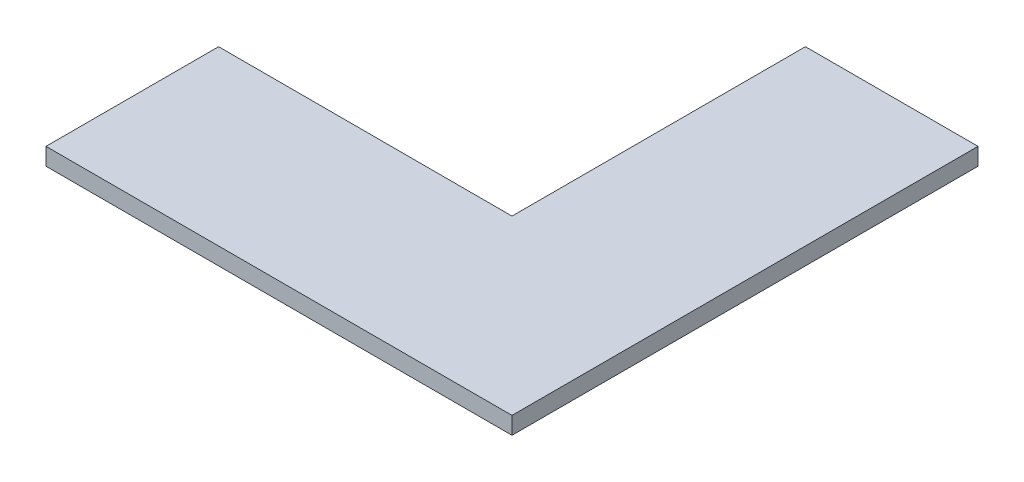
ISO-10303-21;
HEADER;
FILE_DESCRIPTION(('STEP AP214'),'2;1');
FILE_NAME('part.step','',(''),(''),'','','');
FILE_SCHEMA(('AUTOMOTIVE_DESIGN { 1 0 10303 214 1 1 1 1 }'));
ENDSEC;
DATA;
#1=APPLICATION_CONTEXT('core data for automotive mechanical design processes');
#2=APPLICATION_PROTOCOL_DEFINITION('international standard','automotive_design',2000,#1);
#3=PRODUCT_CONTEXT('',#1,'mechanical');
#4=PRODUCT('Part','Part','',(#3));
#5=PRODUCT_RELATED_PRODUCT_CATEGORY('part','',(#4));
#6=PRODUCT_DEFINITION_FORMATION('','',#4);
#7=PRODUCT_DEFINITION_CONTEXT('part definition',#1,'design');
#8=PRODUCT_DEFINITION('design','',#6,#7);
#9=PRODUCT_DEFINITION_SHAPE('','',#8);
#10=(LENGTH_UNIT() NAMED_UNIT(*) SI_UNIT(.MILLI.,.METRE.));
#11=(NAMED_UNIT(*) PLANE_ANGLE_UNIT() SI_UNIT($,.RADIAN.));
#12=(NAMED_UNIT(*) SI_UNIT($,.STERADIAN.) SOLID_ANGLE_UNIT());
#13=UNCERTAINTY_MEASURE_WITH_UNIT(LENGTH_MEASURE(1.E-05),#10,'distance_accuracy_value','');
#14=(GEOMETRIC_REPRESENTATION_CONTEXT(3) GLOBAL_UNCERTAINTY_ASSIGNED_CONTEXT((#13)) GLOBAL_UNIT_ASSIGNED_CONTEXT((#10,
#11,#12)) REPRESENTATION_CONTEXT('',''));
#15=CARTESIAN_POINT('',(0.,0.,0.));
#16=DIRECTION('',(0.,0.,1.));
#17=DIRECTION('',(1.,0.,0.));
#18=AXIS2_PLACEMENT_3D('',#15,#16,#17);
#19=CARTESIAN_POINT('',(135.,10.,135.));
#20=DIRECTION('',(-1.,0.,0.));
#21=DIRECTION('',(0.,0.,1.));
#22=AXIS2_PLACEMENT_3D('',#19,#20,#21);
#23=PLANE('',#22);
#24=DIRECTION('',(0.,0.,-1.));
#25=VECTOR('',#24,1.);
#26=CARTESIAN_POINT('',(135.,0.,135.));
#27=LINE('',#26,#25);
#28=CARTESIAN_POINT('',(135.,0.,135.));
#29=VERTEX_POINT('',#28);
#30=CARTESIAN_POINT('',(135.,0.,-135.));
#31=VERTEX_POINT('',#30);
#32=EDGE_CURVE('E118',#29,#31,#27,.T.);
#33=ORIENTED_EDGE('',*,*,#32,.T.);
#34=DIRECTION('',(0.,-1.,0.));
#35=VECTOR('',#34,1.);
#36=CARTESIAN_POINT('',(135.,10.,-135.));
#37=LINE('',#36,#35);
#38=CARTESIAN_POINT('',(135.,10.,-135.));
#39=VERTEX_POINT('',#38);
#40=EDGE_CURVE('E11',#39,#31,#37,.T.);
#41=ORIENTED_EDGE('',*,*,#40,.F.);
#42=DIRECTION('',(0.,0.,-1.));
#43=VECTOR('',#42,1.);
#44=CARTESIAN_POINT('',(135.,10.,135.));
#45=LINE('',#44,#43);
#46=CARTESIAN_POINT('',(135.,10.,135.));
#47=VERTEX_POINT('',#46);
#48=EDGE_CURVE('E128',#47,#39,#45,.T.);
#49=ORIENTED_EDGE('',*,*,#48,.F.);
#50=DIRECTION('',(0.,-1.,0.));
#51=VECTOR('',#50,1.);
#52=CARTESIAN_POINT('',(135.,10.,135.));
#53=LINE('',#52,#51);
#54=EDGE_CURVE('E114',#47,#29,#53,.T.);
#55=ORIENTED_EDGE('',*,*,#54,.T.);
#56=EDGE_LOOP('',(#33,#41,#49,#55));
#57=FACE_BOUND('',#56,.T.);
#58=ADVANCED_FACE('F34',(#57),#23,.F.);
#59=CARTESIAN_POINT('',(135.,10.,-135.));
#60=DIRECTION('',(0.,0.,1.));
#61=DIRECTION('',(1.,0.,0.));
#62=AXIS2_PLACEMENT_3D('',#59,#60,#61);
#63=PLANE('',#62);
#64=DIRECTION('',(-1.,0.,0.));
#65=VECTOR('',#64,1.);
#66=CARTESIAN_POINT('',(135.,0.,-135.));
#67=LINE('',#66,#65);
#68=CARTESIAN_POINT('',(34.9999999999999,0.,-135.));
#69=VERTEX_POINT('',#68);
#70=EDGE_CURVE('E121',#31,#69,#67,.T.);
#71=ORIENTED_EDGE('',*,*,#70,.T.);
#72=DIRECTION('',(0.,-1.,0.));
#73=VECTOR('',#72,1.);
#74=CARTESIAN_POINT('',(34.9999999999999,10.,-135.));
#75=LINE('',#74,#73);
#76=CARTESIAN_POINT('',(34.9999999999999,10.,-135.));
#77=VERTEX_POINT('',#76);
#78=EDGE_CURVE('E42',#77,#69,#75,.T.);
#79=ORIENTED_EDGE('',*,*,#78,.F.);
#80=DIRECTION('',(-1.,0.,0.));
#81=VECTOR('',#80,1.);
#82=CARTESIAN_POINT('',(135.,10.,-135.));
#83=LINE('',#82,#81);
#84=EDGE_CURVE('E87',#39,#77,#83,.T.);
#85=ORIENTED_EDGE('',*,*,#84,.F.);
#86=ORIENTED_EDGE('',*,*,#40,.T.);
#87=EDGE_LOOP('',(#71,#79,#85,#86));
#88=FACE_BOUND('',#87,.T.);
#89=ADVANCED_FACE('F152',(#88),#63,.F.);
#90=CARTESIAN_POINT('',(34.9999999999999,10.,-135.));
#91=DIRECTION('',(1.,0.,0.));
#92=DIRECTION('',(0.,0.,-1.));
#93=AXIS2_PLACEMENT_3D('',#90,#91,#92);
#94=PLANE('',#93);
#95=DIRECTION('',(0.,0.,1.));
#96=VECTOR('',#95,1.);
#97=CARTESIAN_POINT('',(34.9999999999999,0.,-135.));
#98=LINE('',#97,#96);
#99=CARTESIAN_POINT('',(34.9999999999999,0.,35.));
#100=VERTEX_POINT('',#99);
#101=EDGE_CURVE('E123',#69,#100,#98,.T.);
#102=ORIENTED_EDGE('',*,*,#101,.T.);
#103=DIRECTION('',(0.,-1.,0.));
#104=VECTOR('',#103,1.);
#105=CARTESIAN_POINT('',(34.9999999999999,10.,35.));
#106=LINE('',#105,#104);
#107=CARTESIAN_POINT('',(34.9999999999999,10.,35.));
#108=VERTEX_POINT('',#107);
#109=EDGE_CURVE('E109',#108,#100,#106,.T.);
#110=ORIENTED_EDGE('',*,*,#109,.F.);
#111=DIRECTION('',(0.,0.,1.));
#112=VECTOR('',#111,1.);
#113=CARTESIAN_POINT('',(34.9999999999999,10.,-135.));
#114=LINE('',#113,#112);
#115=EDGE_CURVE('E100',#77,#108,#114,.T.);
#116=ORIENTED_EDGE('',*,*,#115,.F.);
#117=ORIENTED_EDGE('',*,*,#78,.T.);
#118=EDGE_LOOP('',(#102,#110,#116,#117));
#119=FACE_BOUND('',#118,.T.);
#120=ADVANCED_FACE('F134',(#119),#94,.F.);
#121=CARTESIAN_POINT('',(34.9999999999999,10.,35.));
#122=DIRECTION('',(0.,0.,1.));
#123=DIRECTION('',(1.,0.,0.));
#124=AXIS2_PLACEMENT_3D('',#121,#122,#123);
#125=PLANE('',#124);
#126=DIRECTION('',(-1.,0.,0.));
#127=VECTOR('',#126,1.);
#128=CARTESIAN_POINT('',(34.9999999999999,0.,35.));
#129=LINE('',#128,#127);
#130=CARTESIAN_POINT('',(-135.,0.,35.));
#131=VERTEX_POINT('',#130);
#132=EDGE_CURVE('E108',#100,#131,#129,.T.);
#133=ORIENTED_EDGE('',*,*,#132,.T.);
#134=DIRECTION('',(0.,-1.,0.));
#135=VECTOR('',#134,1.);
#136=CARTESIAN_POINT('',(-135.,10.,35.));
#137=LINE('',#136,#135);
#138=CARTESIAN_POINT('',(-135.,10.,35.));
#139=VERTEX_POINT('',#138);
#140=EDGE_CURVE('E105',#139,#131,#137,.T.);
#141=ORIENTED_EDGE('',*,*,#140,.F.);
#142=DIRECTION('',(-1.,0.,0.));
#143=VECTOR('',#142,1.);
#144=CARTESIAN_POINT('',(34.9999999999999,10.,35.));
#145=LINE('',#144,#143);
#146=EDGE_CURVE('E94',#108,#139,#145,.T.);
#147=ORIENTED_EDGE('',*,*,#146,.F.);
#148=ORIENTED_EDGE('',*,*,#109,.T.);
#149=EDGE_LOOP('',(#133,#141,#147,#148));
#150=FACE_BOUND('',#149,.T.);
#151=ADVANCED_FACE('F106',(#150),#125,.F.);
#152=CARTESIAN_POINT('',(-135.,10.,35.));
#153=DIRECTION('',(1.,0.,0.));
#154=DIRECTION('',(0.,0.,-1.));
#155=AXIS2_PLACEMENT_3D('',#152,#153,#154);
#156=PLANE('',#155);
#157=DIRECTION('',(0.,0.,1.));
#158=VECTOR('',#157,1.);
#159=CARTESIAN_POINT('',(-135.,0.,35.));
#160=LINE('',#159,#158);
#161=CARTESIAN_POINT('',(-135.,0.,135.));
#162=VERTEX_POINT('',#161);
#163=EDGE_CURVE('E73',#131,#162,#160,.T.);
#164=ORIENTED_EDGE('',*,*,#163,.T.);
#165=DIRECTION('',(0.,-1.,0.));
#166=VECTOR('',#165,1.);
#167=CARTESIAN_POINT('',(-135.,10.,135.));
#168=LINE('',#167,#166);
#169=CARTESIAN_POINT('',(-135.,10.,135.));
#170=VERTEX_POINT('',#169);
#171=EDGE_CURVE('E110',#170,#162,#168,.T.);
#172=ORIENTED_EDGE('',*,*,#171,.F.);
#173=DIRECTION('',(0.,0.,1.));
#174=VECTOR('',#173,1.);
#175=CARTESIAN_POINT('',(-135.,10.,35.));
#176=LINE('',#175,#174);
#177=EDGE_CURVE('E98',#139,#170,#176,.T.);
#178=ORIENTED_EDGE('',*,*,#177,.F.);
#179=ORIENTED_EDGE('',*,*,#140,.T.);
#180=EDGE_LOOP('',(#164,#172,#178,#179));
#181=FACE_BOUND('',#180,.T.);
#182=ADVANCED_FACE('F112',(#181),#156,.F.);
#183=CARTESIAN_POINT('',(-135.,10.,135.));
#184=DIRECTION('',(0.,0.,-1.));
#185=DIRECTION('',(-1.,0.,0.));
#186=AXIS2_PLACEMENT_3D('',#183,#184,#185);
#187=PLANE('',#186);
#188=DIRECTION('',(1.,0.,0.));
#189=VECTOR('',#188,1.);
#190=CARTESIAN_POINT('',(-135.,0.,135.));
#191=LINE('',#190,#189);
#192=EDGE_CURVE('E79',#162,#29,#191,.T.);
#193=ORIENTED_EDGE('',*,*,#192,.T.);
#194=ORIENTED_EDGE('',*,*,#54,.F.);
#195=DIRECTION('',(1.,0.,0.));
#196=VECTOR('',#195,1.);
#197=CARTESIAN_POINT('',(-135.,10.,135.));
#198=LINE('',#197,#196);
#199=EDGE_CURVE('E50',#170,#47,#198,.T.);
#200=ORIENTED_EDGE('',*,*,#199,.F.);
#201=ORIENTED_EDGE('',*,*,#171,.T.);
#202=EDGE_LOOP('',(#193,#194,#200,#201));
#203=FACE_BOUND('',#202,.T.);
#204=ADVANCED_FACE('F141',(#203),#187,.F.);
#205=CARTESIAN_POINT('',(0.,10.,0.));
#206=DIRECTION('',(0.,1.,0.));
#207=DIRECTION('',(0.,0.,1.));
#208=AXIS2_PLACEMENT_3D('',#205,#206,#207);
#209=PLANE('',#208);
#210=ORIENTED_EDGE('',*,*,#48,.T.);
#211=ORIENTED_EDGE('',*,*,#84,.T.);
#212=ORIENTED_EDGE('',*,*,#115,.T.);
#213=ORIENTED_EDGE('',*,*,#146,.T.);
#214=ORIENTED_EDGE('',*,*,#177,.T.);
#215=ORIENTED_EDGE('',*,*,#199,.T.);
#216=EDGE_LOOP('',(#210,#211,#212,#213,#214,#215));
#217=FACE_BOUND('',#216,.T.);
#218=ADVANCED_FACE('F96',(#217),#209,.T.);
#219=CARTESIAN_POINT('',(0.,0.,0.));
#220=DIRECTION('',(0.,1.,0.));
#221=DIRECTION('',(0.,0.,1.));
#222=AXIS2_PLACEMENT_3D('',#219,#220,#221);
#223=PLANE('',#222);
#224=ORIENTED_EDGE('',*,*,#32,.F.);
#225=ORIENTED_EDGE('',*,*,#192,.F.);
#226=ORIENTED_EDGE('',*,*,#163,.F.);
#227=ORIENTED_EDGE('',*,*,#132,.F.);
#228=ORIENTED_EDGE('',*,*,#101,.F.);
#229=ORIENTED_EDGE('',*,*,#70,.F.);
#230=EDGE_LOOP('',(#224,#225,#226,#227,#228,#229));
#231=FACE_BOUND('',#230,.T.);
#232=ADVANCED_FACE('F137',(#231),#223,.F.);
#233=CLOSED_SHELL('',(#58,#89,#120,#151,#182,#204,#218,#232));
#234=MANIFOLD_SOLID_BREP('B2',#233);
#235=ADVANCED_BREP_SHAPE_REPRESENTATION('',(#18,#234),#14);
#236=SHAPE_DEFINITION_REPRESENTATION(#9,#235);
ENDSEC;
END-ISO-10303-21;
